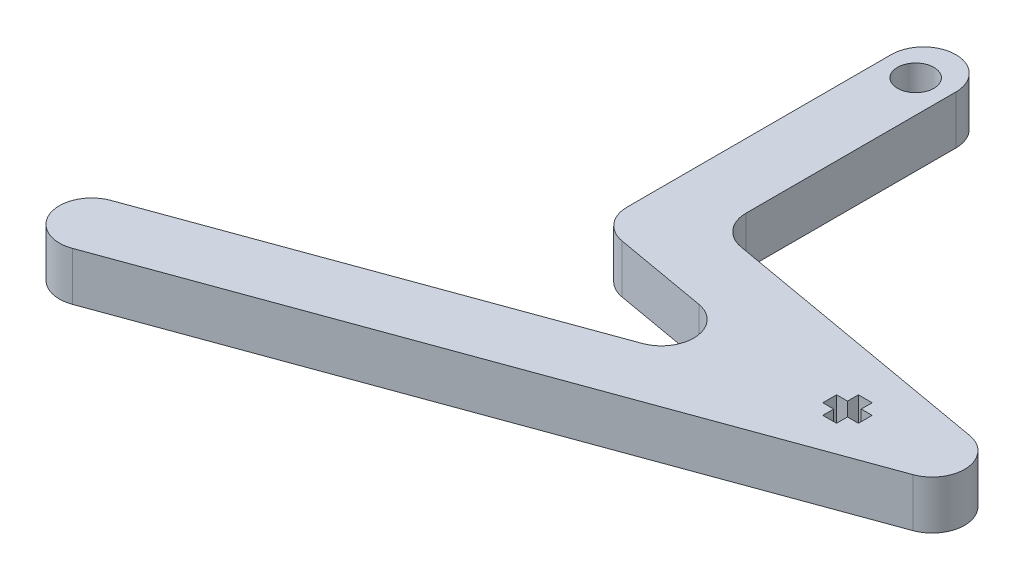
ISO-10303-21;
HEADER;
FILE_DESCRIPTION(('STEP AP214'),'2;1');
FILE_NAME('part.step','',(''),(''),'','','');
FILE_SCHEMA(('AUTOMOTIVE_DESIGN { 1 0 10303 214 1 1 1 1 }'));
ENDSEC;
DATA;
#1=APPLICATION_CONTEXT('core data for automotive mechanical design processes');
#2=APPLICATION_PROTOCOL_DEFINITION('international standard','automotive_design',2000,#1);
#3=PRODUCT_CONTEXT('',#1,'mechanical');
#4=PRODUCT('Part','Part','',(#3));
#5=PRODUCT_RELATED_PRODUCT_CATEGORY('part','',(#4));
#6=PRODUCT_DEFINITION_FORMATION('','',#4);
#7=PRODUCT_DEFINITION_CONTEXT('part definition',#1,'design');
#8=PRODUCT_DEFINITION('design','',#6,#7);
#9=PRODUCT_DEFINITION_SHAPE('','',#8);
#10=(LENGTH_UNIT() NAMED_UNIT(*) SI_UNIT(.MILLI.,.METRE.));
#11=(NAMED_UNIT(*) PLANE_ANGLE_UNIT() SI_UNIT($,.RADIAN.));
#12=(NAMED_UNIT(*) SI_UNIT($,.STERADIAN.) SOLID_ANGLE_UNIT());
#13=UNCERTAINTY_MEASURE_WITH_UNIT(LENGTH_MEASURE(1.E-05),#10,'distance_accuracy_value','');
#14=(GEOMETRIC_REPRESENTATION_CONTEXT(3) GLOBAL_UNCERTAINTY_ASSIGNED_CONTEXT((#13)) GLOBAL_UNIT_ASSIGNED_CONTEXT((#10,
#11,#12)) REPRESENTATION_CONTEXT('',''));
#15=CARTESIAN_POINT('',(0.,0.,0.));
#16=DIRECTION('',(0.,0.,1.));
#17=DIRECTION('',(1.,0.,0.));
#18=AXIS2_PLACEMENT_3D('',#15,#16,#17);
#19=CARTESIAN_POINT('',(0.,6.,0.));
#20=DIRECTION('',(0.,1.,0.));
#21=DIRECTION('',(0.,0.,1.));
#22=AXIS2_PLACEMENT_3D('',#19,#20,#21);
#23=PLANE('',#22);
#24=DIRECTION('',(0.,0.,1.));
#25=VECTOR('',#24,1.);
#26=CARTESIAN_POINT('',(-38.433012349143,6.,-5.2517052601802));
#27=LINE('',#26,#25);
#28=CARTESIAN_POINT('',(-38.433012349143,6.,-5.2517052601802));
#29=VERTEX_POINT('',#28);
#30=CARTESIAN_POINT('',(-38.433012349143,6.,-3.5517052601802));
#31=VERTEX_POINT('',#30);
#32=EDGE_CURVE('E229',#29,#31,#27,.T.);
#33=ORIENTED_EDGE('',*,*,#32,.F.);
#34=DIRECTION('',(-1.,0.,0.));
#35=VECTOR('',#34,1.);
#36=CARTESIAN_POINT('',(-37.083012349143,6.,-5.2517052601802));
#37=LINE('',#36,#35);
#38=CARTESIAN_POINT('',(-37.083012349143,6.,-5.2517052601802));
#39=VERTEX_POINT('',#38);
#40=EDGE_CURVE('E219',#39,#29,#37,.T.);
#41=ORIENTED_EDGE('',*,*,#40,.F.);
#42=DIRECTION('',(0.,0.,1.));
#43=VECTOR('',#42,1.);
#44=CARTESIAN_POINT('',(-37.083012349143,6.,-6.60170526018021));
#45=LINE('',#44,#43);
#46=CARTESIAN_POINT('',(-37.083012349143,6.,-6.60170526018021));
#47=VERTEX_POINT('',#46);
#48=EDGE_CURVE('E264',#47,#39,#45,.T.);
#49=ORIENTED_EDGE('',*,*,#48,.F.);
#50=DIRECTION('',(-1.,0.,0.));
#51=VECTOR('',#50,1.);
#52=CARTESIAN_POINT('',(-35.383012349143,6.,-6.60170526018021));
#53=LINE('',#52,#51);
#54=CARTESIAN_POINT('',(-35.383012349143,6.,-6.60170526018021));
#55=VERTEX_POINT('',#54);
#56=EDGE_CURVE('E261',#55,#47,#53,.T.);
#57=ORIENTED_EDGE('',*,*,#56,.F.);
#58=DIRECTION('',(0.,0.,-1.));
#59=VECTOR('',#58,1.);
#60=CARTESIAN_POINT('',(-35.383012349143,6.,-5.2517052601802));
#61=LINE('',#60,#59);
#62=CARTESIAN_POINT('',(-35.383012349143,6.,-5.2517052601802));
#63=VERTEX_POINT('',#62);
#64=EDGE_CURVE('E259',#63,#55,#61,.T.);
#65=ORIENTED_EDGE('',*,*,#64,.F.);
#66=DIRECTION('',(-1.,0.,0.));
#67=VECTOR('',#66,1.);
#68=CARTESIAN_POINT('',(-34.033012349143,6.,-5.2517052601802));
#69=LINE('',#68,#67);
#70=CARTESIAN_POINT('',(-34.033012349143,6.,-5.2517052601802));
#71=VERTEX_POINT('',#70);
#72=EDGE_CURVE('E257',#71,#63,#69,.T.);
#73=ORIENTED_EDGE('',*,*,#72,.F.);
#74=DIRECTION('',(0.,0.,-1.));
#75=VECTOR('',#74,1.);
#76=CARTESIAN_POINT('',(-34.033012349143,6.,-3.5517052601802));
#77=LINE('',#76,#75);
#78=CARTESIAN_POINT('',(-34.033012349143,6.,-3.5517052601802));
#79=VERTEX_POINT('',#78);
#80=EDGE_CURVE('E255',#79,#71,#77,.T.);
#81=ORIENTED_EDGE('',*,*,#80,.F.);
#82=DIRECTION('',(1.,0.,0.));
#83=VECTOR('',#82,1.);
#84=CARTESIAN_POINT('',(-35.383012349143,6.,-3.5517052601802));
#85=LINE('',#84,#83);
#86=CARTESIAN_POINT('',(-35.383012349143,6.,-3.5517052601802));
#87=VERTEX_POINT('',#86);
#88=EDGE_CURVE('E253',#87,#79,#85,.T.);
#89=ORIENTED_EDGE('',*,*,#88,.F.);
#90=DIRECTION('',(0.,0.,-1.));
#91=VECTOR('',#90,1.);
#92=CARTESIAN_POINT('',(-35.383012349143,6.,-2.2017052601802));
#93=LINE('',#92,#91);
#94=CARTESIAN_POINT('',(-35.383012349143,6.,-2.2017052601802));
#95=VERTEX_POINT('',#94);
#96=EDGE_CURVE('E251',#95,#87,#93,.T.);
#97=ORIENTED_EDGE('',*,*,#96,.F.);
#98=DIRECTION('',(1.,0.,0.));
#99=VECTOR('',#98,1.);
#100=CARTESIAN_POINT('',(-37.083012349143,6.,-2.2017052601802));
#101=LINE('',#100,#99);
#102=CARTESIAN_POINT('',(-37.083012349143,6.,-2.2017052601802));
#103=VERTEX_POINT('',#102);
#104=EDGE_CURVE('E249',#103,#95,#101,.T.);
#105=ORIENTED_EDGE('',*,*,#104,.F.);
#106=DIRECTION('',(0.,0.,1.));
#107=VECTOR('',#106,1.);
#108=CARTESIAN_POINT('',(-37.083012349143,6.,-3.5517052601802));
#109=LINE('',#108,#107);
#110=CARTESIAN_POINT('',(-37.083012349143,6.,-3.5517052601802));
#111=VERTEX_POINT('',#110);
#112=EDGE_CURVE('E244',#111,#103,#109,.T.);
#113=ORIENTED_EDGE('',*,*,#112,.F.);
#114=DIRECTION('',(1.,0.,0.));
#115=VECTOR('',#114,1.);
#116=CARTESIAN_POINT('',(-38.433012349143,6.,-3.5517052601802));
#117=LINE('',#116,#115);
#118=EDGE_CURVE('E242',#31,#111,#117,.T.);
#119=ORIENTED_EDGE('',*,*,#118,.F.);
#120=EDGE_LOOP('',(#33,#41,#49,#57,#65,#73,#81,#89,#97,#105,#113,#119));
#121=FACE_BOUND('',#120,.T.);
#122=DIRECTION('',(0.,0.,1.));
#123=VECTOR('',#122,1.);
#124=CARTESIAN_POINT('',(-71.4790407486558,6.,-49.0484446942367));
#125=LINE('',#124,#123);
#126=CARTESIAN_POINT('',(-71.4790407486558,6.,-45.0484446942367));
#127=VERTEX_POINT('',#126);
#128=CARTESIAN_POINT('',(-71.4790407486558,6.,-12.4048432189458));
#129=VERTEX_POINT('',#128);
#130=EDGE_CURVE('E319',#127,#129,#125,.T.);
#131=ORIENTED_EDGE('',*,*,#130,.T.);
#132=CARTESIAN_POINT('',(-67.4790407486558,6.,-12.4048432189458));
#133=DIRECTION('',(0.,1.,0.));
#134=DIRECTION('',(0.,0.,1.));
#135=AXIS2_PLACEMENT_3D('',#132,#133,#134);
#136=CIRCLE('',#135,4.);
#137=CARTESIAN_POINT('',(-68.1736334593235,6.,-8.46561220689699));
#138=VERTEX_POINT('',#137);
#139=EDGE_CURVE('E393',#129,#138,#136,.T.);
#140=ORIENTED_EDGE('',*,*,#139,.T.);
#141=DIRECTION('',(0.984807753012207,0.,0.173648177666934));
#142=VECTOR('',#141,1.);
#143=CARTESIAN_POINT('',(-71.4790407486558,6.,-9.04844469423671));
#144=LINE('',#143,#142);
#145=CARTESIAN_POINT('',(-56.636218438007,6.,-6.43125465100771));
#146=VERTEX_POINT('',#145);
#147=EDGE_CURVE('E322',#138,#146,#144,.T.);
#148=ORIENTED_EDGE('',*,*,#147,.T.);
#149=CARTESIAN_POINT('',(-57.3308111486747,6.,-2.49202363895887));
#150=DIRECTION('',(0.,1.,0.));
#151=DIRECTION('',(0.,0.,1.));
#152=AXIS2_PLACEMENT_3D('',#149,#150,#151);
#153=CIRCLE('',#152,4.);
#154=CARTESIAN_POINT('',(-55.962730575372,6.,1.26674684418477));
#155=VERTEX_POINT('',#154);
#156=EDGE_CURVE('E11',#146,#155,#153,.F.);
#157=ORIENTED_EDGE('',*,*,#156,.T.);
#158=DIRECTION('',(-0.939692620785912,0.,0.34202014332566));
#159=VECTOR('',#158,1.);
#160=CARTESIAN_POINT('',(-41.9348081582896,6.,-3.83899936422869));
#161=LINE('',#160,#159);
#162=CARTESIAN_POINT('',(-104.089454919572,6.,18.7834419782077));
#163=VERTEX_POINT('',#162);
#164=EDGE_CURVE('E326',#155,#163,#161,.T.);
#165=ORIENTED_EDGE('',*,*,#164,.T.);
#166=CARTESIAN_POINT('',(-102.72137434627,6.,22.5422124613514));
#167=DIRECTION('',(0.,1.,0.));
#168=DIRECTION('',(0.,0.,1.));
#169=AXIS2_PLACEMENT_3D('',#166,#167,#168);
#170=CIRCLE('',#169,4.);
#171=CARTESIAN_POINT('',(-106.480144829413,6.,23.910293034654));
#172=VERTEX_POINT('',#171);
#173=EDGE_CURVE('E390',#163,#172,#170,.T.);
#174=ORIENTED_EDGE('',*,*,#173,.T.);
#175=CARTESIAN_POINT('',(-102.72137434627,6.,22.5422124613514));
#176=DIRECTION('',(0.,1.,0.));
#177=DIRECTION('',(0.,0.,1.));
#178=AXIS2_PLACEMENT_3D('',#175,#176,#177);
#179=CIRCLE('',#178,4.);
#180=CARTESIAN_POINT('',(-101.353293772967,6.,26.300982944495));
#181=VERTEX_POINT('',#180);
#182=EDGE_CURVE('E67',#172,#181,#179,.T.);
#183=ORIENTED_EDGE('',*,*,#182,.T.);
#184=DIRECTION('',(0.939692620785912,0.,-0.34202014332566));
#185=VECTOR('',#184,1.);
#186=CARTESIAN_POINT('',(-105.112064256111,6.,27.6690635177977));
#187=LINE('',#186,#185);
#188=CARTESIAN_POINT('',(-25.1707245946019,6.,-1.42720460635487));
#189=VERTEX_POINT('',#188);
#190=EDGE_CURVE('E329',#181,#189,#187,.T.);
#191=ORIENTED_EDGE('',*,*,#190,.T.);
#192=CARTESIAN_POINT('',(-26.5388051679045,6.,-5.18597508949852));
#193=DIRECTION('',(0.,1.,0.));
#194=DIRECTION('',(0.,0.,1.));
#195=AXIS2_PLACEMENT_3D('',#192,#193,#194);
#196=CIRCLE('',#195,4.);
#197=CARTESIAN_POINT('',(-25.8442124572368,6.,-9.12520610154735));
#198=VERTEX_POINT('',#197);
#199=EDGE_CURVE('E388',#189,#198,#196,.T.);
#200=ORIENTED_EDGE('',*,*,#199,.T.);
#201=DIRECTION('',(-0.984807753012207,0.,-0.173648177666934));
#202=VECTOR('',#201,1.);
#203=CARTESIAN_POINT('',(-63.4790407486558,6.,-15.7612417436549));
#204=LINE('',#203,#202);
#205=CARTESIAN_POINT('',(-60.1736334593235,6.,-15.1784092563152));
#206=VERTEX_POINT('',#205);
#207=EDGE_CURVE('E331',#198,#206,#204,.T.);
#208=ORIENTED_EDGE('',*,*,#207,.T.);
#209=CARTESIAN_POINT('',(-59.4790407486558,6.,-19.117640268364));
#210=DIRECTION('',(0.,1.,0.));
#211=DIRECTION('',(0.,0.,1.));
#212=AXIS2_PLACEMENT_3D('',#209,#210,#211);
#213=CIRCLE('',#212,4.);
#214=CARTESIAN_POINT('',(-63.4790407486558,6.,-19.117640268364));
#215=VERTEX_POINT('',#214);
#216=EDGE_CURVE('E406',#206,#215,#213,.F.);
#217=ORIENTED_EDGE('',*,*,#216,.T.);
#218=DIRECTION('',(0.,0.,-1.));
#219=VECTOR('',#218,1.);
#220=CARTESIAN_POINT('',(-63.4790407486558,6.,-15.7612417436549));
#221=LINE('',#220,#219);
#222=CARTESIAN_POINT('',(-63.4790407486558,6.,-45.0484446942367));
#223=VERTEX_POINT('',#222);
#224=EDGE_CURVE('E334',#215,#223,#221,.T.);
#225=ORIENTED_EDGE('',*,*,#224,.T.);
#226=CARTESIAN_POINT('',(-67.4790407486558,6.,-45.0484446942367));
#227=DIRECTION('',(0.,1.,0.));
#228=DIRECTION('',(0.,0.,1.));
#229=AXIS2_PLACEMENT_3D('',#226,#227,#228);
#230=CIRCLE('',#229,4.);
#231=CARTESIAN_POINT('',(-67.4790407486558,6.,-49.0484446942367));
#232=VERTEX_POINT('',#231);
#233=EDGE_CURVE('E386',#223,#232,#230,.T.);
#234=ORIENTED_EDGE('',*,*,#233,.T.);
#235=CARTESIAN_POINT('',(-67.4790407486558,6.,-45.0484446942367));
#236=DIRECTION('',(0.,1.,0.));
#237=DIRECTION('',(0.,0.,1.));
#238=AXIS2_PLACEMENT_3D('',#235,#236,#237);
#239=CIRCLE('',#238,4.);
#240=EDGE_CURVE('E384',#232,#127,#239,.T.);
#241=ORIENTED_EDGE('',*,*,#240,.T.);
#242=EDGE_LOOP('',(#131,#140,#148,#157,#165,#174,#183,#191,#200,#208,#217,#225,#234,#241));
#243=FACE_BOUND('',#242,.T.);
#244=CARTESIAN_POINT('',(-67.4790407486558,6.,-44.0774757166165));
#245=DIRECTION('',(0.,1.,0.));
#246=DIRECTION('',(0.,0.,1.));
#247=AXIS2_PLACEMENT_3D('',#244,#245,#246);
#248=CIRCLE('',#247,2.25);
#249=CARTESIAN_POINT('',(-67.4790407486558,6.,-41.8274757166165));
#250=VERTEX_POINT('',#249);
#251=EDGE_CURVE('E268',#250,#250,#248,.T.);
#252=ORIENTED_EDGE('',*,*,#251,.F.);
#253=EDGE_LOOP('',(#252));
#254=FACE_BOUND('',#253,.T.);
#255=ADVANCED_FACE('F43',(#121,#243,#254),#23,.T.);
#256=CARTESIAN_POINT('',(0.,0.,0.));
#257=DIRECTION('',(0.,1.,0.));
#258=DIRECTION('',(0.,0.,1.));
#259=AXIS2_PLACEMENT_3D('',#256,#257,#258);
#260=PLANE('',#259);
#261=DIRECTION('',(0.984807753012207,0.,0.173648177666934));
#262=VECTOR('',#261,1.);
#263=CARTESIAN_POINT('',(-71.4790407486558,0.,-9.04844469423671));
#264=LINE('',#263,#262);
#265=CARTESIAN_POINT('',(-68.1736334593235,0.,-8.46561220689699));
#266=VERTEX_POINT('',#265);
#267=CARTESIAN_POINT('',(-56.636218438007,0.,-6.43125465100771));
#268=VERTEX_POINT('',#267);
#269=EDGE_CURVE('E340',#266,#268,#264,.T.);
#270=ORIENTED_EDGE('',*,*,#269,.F.);
#271=CARTESIAN_POINT('',(-67.4790407486558,0.,-12.4048432189458));
#272=DIRECTION('',(0.,1.,0.));
#273=DIRECTION('',(0.,0.,1.));
#274=AXIS2_PLACEMENT_3D('',#271,#272,#273);
#275=CIRCLE('',#274,4.);
#276=CARTESIAN_POINT('',(-71.4790407486558,0.,-12.4048432189458));
#277=VERTEX_POINT('',#276);
#278=EDGE_CURVE('E378',#266,#277,#275,.F.);
#279=ORIENTED_EDGE('',*,*,#278,.T.);
#280=DIRECTION('',(0.,0.,1.));
#281=VECTOR('',#280,1.);
#282=CARTESIAN_POINT('',(-71.4790407486558,0.,-49.0484446942367));
#283=LINE('',#282,#281);
#284=CARTESIAN_POINT('',(-71.4790407486558,0.,-45.0484446942367));
#285=VERTEX_POINT('',#284);
#286=EDGE_CURVE('E237',#285,#277,#283,.T.);
#287=ORIENTED_EDGE('',*,*,#286,.F.);
#288=CARTESIAN_POINT('',(-67.4790407486558,0.,-45.0484446942367));
#289=DIRECTION('',(0.,1.,0.));
#290=DIRECTION('',(0.,0.,1.));
#291=AXIS2_PLACEMENT_3D('',#288,#289,#290);
#292=CIRCLE('',#291,4.);
#293=CARTESIAN_POINT('',(-67.4790407486558,0.,-49.0484446942367));
#294=VERTEX_POINT('',#293);
#295=EDGE_CURVE('E368',#285,#294,#292,.F.);
#296=ORIENTED_EDGE('',*,*,#295,.T.);
#297=CARTESIAN_POINT('',(-67.4790407486558,0.,-45.0484446942367));
#298=DIRECTION('',(0.,1.,0.));
#299=DIRECTION('',(0.,0.,1.));
#300=AXIS2_PLACEMENT_3D('',#297,#298,#299);
#301=CIRCLE('',#300,4.);
#302=CARTESIAN_POINT('',(-63.4790407486558,0.,-45.0484446942367));
#303=VERTEX_POINT('',#302);
#304=EDGE_CURVE('E370',#294,#303,#301,.F.);
#305=ORIENTED_EDGE('',*,*,#304,.T.);
#306=DIRECTION('',(0.,0.,-1.));
#307=VECTOR('',#306,1.);
#308=CARTESIAN_POINT('',(-63.4790407486558,0.,-15.7612417436549));
#309=LINE('',#308,#307);
#310=CARTESIAN_POINT('',(-63.4790407486558,0.,-19.117640268364));
#311=VERTEX_POINT('',#310);
#312=EDGE_CURVE('E323',#311,#303,#309,.T.);
#313=ORIENTED_EDGE('',*,*,#312,.F.);
#314=CARTESIAN_POINT('',(-59.4790407486558,0.,-19.117640268364));
#315=DIRECTION('',(0.,1.,0.));
#316=DIRECTION('',(0.,0.,1.));
#317=AXIS2_PLACEMENT_3D('',#314,#315,#316);
#318=CIRCLE('',#317,4.);
#319=CARTESIAN_POINT('',(-60.1736334593235,0.,-15.1784092563152));
#320=VERTEX_POINT('',#319);
#321=EDGE_CURVE('E404',#311,#320,#318,.T.);
#322=ORIENTED_EDGE('',*,*,#321,.T.);
#323=DIRECTION('',(-0.984807753012207,0.,-0.173648177666934));
#324=VECTOR('',#323,1.);
#325=CARTESIAN_POINT('',(-63.4790407486558,0.,-15.7612417436549));
#326=LINE('',#325,#324);
#327=CARTESIAN_POINT('',(-25.8442124572368,0.,-9.12520610154735));
#328=VERTEX_POINT('',#327);
#329=EDGE_CURVE('E348',#328,#320,#326,.T.);
#330=ORIENTED_EDGE('',*,*,#329,.F.);
#331=CARTESIAN_POINT('',(-26.5388051679045,0.,-5.18597508949852));
#332=DIRECTION('',(0.,1.,0.));
#333=DIRECTION('',(0.,0.,1.));
#334=AXIS2_PLACEMENT_3D('',#331,#332,#333);
#335=CIRCLE('',#334,4.);
#336=CARTESIAN_POINT('',(-25.1707245946019,0.,-1.42720460635487));
#337=VERTEX_POINT('',#336);
#338=EDGE_CURVE('E372',#328,#337,#335,.F.);
#339=ORIENTED_EDGE('',*,*,#338,.T.);
#340=DIRECTION('',(0.939692620785912,0.,-0.34202014332566));
#341=VECTOR('',#340,1.);
#342=CARTESIAN_POINT('',(-105.112064256111,0.,27.6690635177977));
#343=LINE('',#342,#341);
#344=CARTESIAN_POINT('',(-101.353293772967,0.,26.300982944495));
#345=VERTEX_POINT('',#344);
#346=EDGE_CURVE('E346',#345,#337,#343,.T.);
#347=ORIENTED_EDGE('',*,*,#346,.F.);
#348=CARTESIAN_POINT('',(-102.72137434627,0.,22.5422124613514));
#349=DIRECTION('',(0.,1.,0.));
#350=DIRECTION('',(0.,0.,1.));
#351=AXIS2_PLACEMENT_3D('',#348,#349,#350);
#352=CIRCLE('',#351,4.);
#353=CARTESIAN_POINT('',(-106.480144829413,0.,23.910293034654));
#354=VERTEX_POINT('',#353);
#355=EDGE_CURVE('E376',#345,#354,#352,.F.);
#356=ORIENTED_EDGE('',*,*,#355,.T.);
#357=CARTESIAN_POINT('',(-102.72137434627,0.,22.5422124613514));
#358=DIRECTION('',(0.,1.,0.));
#359=DIRECTION('',(0.,0.,1.));
#360=AXIS2_PLACEMENT_3D('',#357,#358,#359);
#361=CIRCLE('',#360,4.);
#362=CARTESIAN_POINT('',(-104.089454919572,0.,18.7834419782077));
#363=VERTEX_POINT('',#362);
#364=EDGE_CURVE('E374',#354,#363,#361,.F.);
#365=ORIENTED_EDGE('',*,*,#364,.T.);
#366=DIRECTION('',(-0.939692620785912,0.,0.34202014332566));
#367=VECTOR('',#366,1.);
#368=CARTESIAN_POINT('',(-41.9348081582896,0.,-3.83899936422869));
#369=LINE('',#368,#367);
#370=CARTESIAN_POINT('',(-55.962730575372,0.,1.26674684418477));
#371=VERTEX_POINT('',#370);
#372=EDGE_CURVE('E343',#371,#363,#369,.T.);
#373=ORIENTED_EDGE('',*,*,#372,.F.);
#374=CARTESIAN_POINT('',(-57.3308111486747,0.,-2.49202363895887));
#375=DIRECTION('',(0.,1.,0.));
#376=DIRECTION('',(0.,0.,1.));
#377=AXIS2_PLACEMENT_3D('',#374,#375,#376);
#378=CIRCLE('',#377,4.);
#379=EDGE_CURVE('E52',#371,#268,#378,.T.);
#380=ORIENTED_EDGE('',*,*,#379,.T.);
#381=EDGE_LOOP('',(#270,#279,#287,#296,#305,#313,#322,#330,#339,#347,#356,#365,#373,#380));
#382=FACE_BOUND('',#381,.T.);
#383=DIRECTION('',(-1.,0.,0.));
#384=VECTOR('',#383,1.);
#385=CARTESIAN_POINT('',(-37.083012349143,0.,-5.2517052601802));
#386=LINE('',#385,#384);
#387=CARTESIAN_POINT('',(-37.083012349143,0.,-5.2517052601802));
#388=VERTEX_POINT('',#387);
#389=CARTESIAN_POINT('',(-38.433012349143,0.,-5.2517052601802));
#390=VERTEX_POINT('',#389);
#391=EDGE_CURVE('E266',#388,#390,#386,.T.);
#392=ORIENTED_EDGE('',*,*,#391,.T.);
#393=DIRECTION('',(0.,0.,1.));
#394=VECTOR('',#393,1.);
#395=CARTESIAN_POINT('',(-38.433012349143,0.,-5.2517052601802));
#396=LINE('',#395,#394);
#397=CARTESIAN_POINT('',(-38.433012349143,0.,-3.5517052601802));
#398=VERTEX_POINT('',#397);
#399=EDGE_CURVE('E236',#390,#398,#396,.T.);
#400=ORIENTED_EDGE('',*,*,#399,.T.);
#401=DIRECTION('',(1.,0.,0.));
#402=VECTOR('',#401,1.);
#403=CARTESIAN_POINT('',(-38.433012349143,0.,-3.5517052601802));
#404=LINE('',#403,#402);
#405=CARTESIAN_POINT('',(-37.083012349143,0.,-3.5517052601802));
#406=VERTEX_POINT('',#405);
#407=EDGE_CURVE('E270',#398,#406,#404,.T.);
#408=ORIENTED_EDGE('',*,*,#407,.T.);
#409=DIRECTION('',(0.,0.,1.));
#410=VECTOR('',#409,1.);
#411=CARTESIAN_POINT('',(-37.083012349143,0.,-3.5517052601802));
#412=LINE('',#411,#410);
#413=CARTESIAN_POINT('',(-37.083012349143,0.,-2.2017052601802));
#414=VERTEX_POINT('',#413);
#415=EDGE_CURVE('E273',#406,#414,#412,.T.);
#416=ORIENTED_EDGE('',*,*,#415,.T.);
#417=DIRECTION('',(1.,0.,0.));
#418=VECTOR('',#417,1.);
#419=CARTESIAN_POINT('',(-37.083012349143,0.,-2.2017052601802));
#420=LINE('',#419,#418);
#421=CARTESIAN_POINT('',(-35.383012349143,0.,-2.2017052601802));
#422=VERTEX_POINT('',#421);
#423=EDGE_CURVE('E276',#414,#422,#420,.T.);
#424=ORIENTED_EDGE('',*,*,#423,.T.);
#425=DIRECTION('',(0.,0.,-1.));
#426=VECTOR('',#425,1.);
#427=CARTESIAN_POINT('',(-35.383012349143,0.,-2.2017052601802));
#428=LINE('',#427,#426);
#429=CARTESIAN_POINT('',(-35.383012349143,0.,-3.5517052601802));
#430=VERTEX_POINT('',#429);
#431=EDGE_CURVE('E279',#422,#430,#428,.T.);
#432=ORIENTED_EDGE('',*,*,#431,.T.);
#433=DIRECTION('',(1.,0.,0.));
#434=VECTOR('',#433,1.);
#435=CARTESIAN_POINT('',(-35.383012349143,0.,-3.5517052601802));
#436=LINE('',#435,#434);
#437=CARTESIAN_POINT('',(-34.033012349143,0.,-3.5517052601802));
#438=VERTEX_POINT('',#437);
#439=EDGE_CURVE('E282',#430,#438,#436,.T.);
#440=ORIENTED_EDGE('',*,*,#439,.T.);
#441=DIRECTION('',(0.,0.,-1.));
#442=VECTOR('',#441,1.);
#443=CARTESIAN_POINT('',(-34.033012349143,0.,-3.5517052601802));
#444=LINE('',#443,#442);
#445=CARTESIAN_POINT('',(-34.033012349143,0.,-5.2517052601802));
#446=VERTEX_POINT('',#445);
#447=EDGE_CURVE('E285',#438,#446,#444,.T.);
#448=ORIENTED_EDGE('',*,*,#447,.T.);
#449=DIRECTION('',(-1.,0.,0.));
#450=VECTOR('',#449,1.);
#451=CARTESIAN_POINT('',(-34.033012349143,0.,-5.2517052601802));
#452=LINE('',#451,#450);
#453=CARTESIAN_POINT('',(-35.383012349143,0.,-5.2517052601802));
#454=VERTEX_POINT('',#453);
#455=EDGE_CURVE('E288',#446,#454,#452,.T.);
#456=ORIENTED_EDGE('',*,*,#455,.T.);
#457=DIRECTION('',(0.,0.,-1.));
#458=VECTOR('',#457,1.);
#459=CARTESIAN_POINT('',(-35.383012349143,0.,-5.2517052601802));
#460=LINE('',#459,#458);
#461=CARTESIAN_POINT('',(-35.383012349143,0.,-6.60170526018021));
#462=VERTEX_POINT('',#461);
#463=EDGE_CURVE('E291',#454,#462,#460,.T.);
#464=ORIENTED_EDGE('',*,*,#463,.T.);
#465=DIRECTION('',(-1.,0.,0.));
#466=VECTOR('',#465,1.);
#467=CARTESIAN_POINT('',(-35.383012349143,0.,-6.60170526018021));
#468=LINE('',#467,#466);
#469=CARTESIAN_POINT('',(-37.083012349143,0.,-6.60170526018021));
#470=VERTEX_POINT('',#469);
#471=EDGE_CURVE('E294',#462,#470,#468,.T.);
#472=ORIENTED_EDGE('',*,*,#471,.T.);
#473=DIRECTION('',(0.,0.,1.));
#474=VECTOR('',#473,1.);
#475=CARTESIAN_POINT('',(-37.083012349143,0.,-6.60170526018021));
#476=LINE('',#475,#474);
#477=EDGE_CURVE('E230',#470,#388,#476,.T.);
#478=ORIENTED_EDGE('',*,*,#477,.T.);
#479=EDGE_LOOP('',(#392,#400,#408,#416,#424,#432,#440,#448,#456,#464,#472,#478));
#480=FACE_BOUND('',#479,.T.);
#481=CARTESIAN_POINT('',(-67.4790407486558,0.,-44.0774757166165));
#482=DIRECTION('',(0.,1.,0.));
#483=DIRECTION('',(0.,0.,1.));
#484=AXIS2_PLACEMENT_3D('',#481,#482,#483);
#485=CIRCLE('',#484,2.25);
#486=CARTESIAN_POINT('',(-67.4790407486558,0.,-41.8274757166165));
#487=VERTEX_POINT('',#486);
#488=EDGE_CURVE('E410',#487,#487,#485,.T.);
#489=ORIENTED_EDGE('',*,*,#488,.T.);
#490=EDGE_LOOP('',(#489));
#491=FACE_BOUND('',#490,.T.);
#492=ADVANCED_FACE('F457',(#382,#480,#491),#260,.F.);
#493=CARTESIAN_POINT('',(-71.4790407486558,6.,-49.0484446942367));
#494=DIRECTION('',(1.,0.,0.));
#495=DIRECTION('',(0.,0.,-1.));
#496=AXIS2_PLACEMENT_3D('',#493,#494,#495);
#497=PLANE('',#496);
#498=ORIENTED_EDGE('',*,*,#286,.T.);
#499=DIRECTION('',(0.,-1.,0.));
#500=VECTOR('',#499,1.);
#501=CARTESIAN_POINT('',(-71.4790407486558,6.,-12.4048432189458));
#502=LINE('',#501,#500);
#503=EDGE_CURVE('E382',#277,#129,#502,.F.);
#504=ORIENTED_EDGE('',*,*,#503,.T.);
#505=ORIENTED_EDGE('',*,*,#130,.F.);
#506=DIRECTION('',(0.,-1.,0.));
#507=VECTOR('',#506,1.);
#508=CARTESIAN_POINT('',(-71.4790407486558,6.,-45.0484446942367));
#509=LINE('',#508,#507);
#510=EDGE_CURVE('E380',#127,#285,#509,.T.);
#511=ORIENTED_EDGE('',*,*,#510,.T.);
#512=EDGE_LOOP('',(#498,#504,#505,#511));
#513=FACE_BOUND('',#512,.T.);
#514=ADVANCED_FACE('F428',(#513),#497,.F.);
#515=CARTESIAN_POINT('',(-71.4790407486558,6.,-9.04844469423671));
#516=DIRECTION('',(0.173648177666934,0.,-0.984807753012207));
#517=DIRECTION('',(-0.984807753012208,0.,-0.173648177666934));
#518=AXIS2_PLACEMENT_3D('',#515,#516,#517);
#519=PLANE('',#518);
#520=ORIENTED_EDGE('',*,*,#147,.F.);
#521=DIRECTION('',(0.,-1.,0.));
#522=VECTOR('',#521,1.);
#523=CARTESIAN_POINT('',(-68.1736334593235,6.,-8.46561220689699));
#524=LINE('',#523,#522);
#525=EDGE_CURVE('E365',#138,#266,#524,.T.);
#526=ORIENTED_EDGE('',*,*,#525,.T.);
#527=ORIENTED_EDGE('',*,*,#269,.T.);
#528=DIRECTION('',(0.,-1.,0.));
#529=VECTOR('',#528,1.);
#530=CARTESIAN_POINT('',(-56.636218438007,6.,-6.4312546510077));
#531=LINE('',#530,#529);
#532=EDGE_CURVE('E363',#268,#146,#531,.F.);
#533=ORIENTED_EDGE('',*,*,#532,.T.);
#534=EDGE_LOOP('',(#520,#526,#527,#533));
#535=FACE_BOUND('',#534,.T.);
#536=ADVANCED_FACE('F437',(#535),#519,.F.);
#537=CARTESIAN_POINT('',(-41.9348081582896,6.,-3.83899936422869));
#538=DIRECTION('',(0.34202014332566,0.,0.939692620785912));
#539=DIRECTION('',(0.939692620785912,0.,-0.34202014332566));
#540=AXIS2_PLACEMENT_3D('',#537,#538,#539);
#541=PLANE('',#540);
#542=ORIENTED_EDGE('',*,*,#372,.T.);
#543=DIRECTION('',(0.,-1.,0.));
#544=VECTOR('',#543,1.);
#545=CARTESIAN_POINT('',(-104.089454919572,6.,18.7834419782077));
#546=LINE('',#545,#544);
#547=EDGE_CURVE('E402',#363,#163,#546,.F.);
#548=ORIENTED_EDGE('',*,*,#547,.T.);
#549=ORIENTED_EDGE('',*,*,#164,.F.);
#550=DIRECTION('',(0.,-1.,0.));
#551=VECTOR('',#550,1.);
#552=CARTESIAN_POINT('',(-55.962730575372,0.,1.26674684418478));
#553=LINE('',#552,#551);
#554=EDGE_CURVE('E399',#155,#371,#553,.T.);
#555=ORIENTED_EDGE('',*,*,#554,.T.);
#556=EDGE_LOOP('',(#542,#548,#549,#555));
#557=FACE_BOUND('',#556,.T.);
#558=ADVANCED_FACE('F446',(#557),#541,.F.);
#559=CARTESIAN_POINT('',(-105.112064256111,6.,27.6690635177977));
#560=DIRECTION('',(-0.34202014332566,0.,-0.939692620785912));
#561=DIRECTION('',(-0.939692620785912,0.,0.34202014332566));
#562=AXIS2_PLACEMENT_3D('',#559,#560,#561);
#563=PLANE('',#562);
#564=ORIENTED_EDGE('',*,*,#190,.F.);
#565=DIRECTION('',(0.,-1.,0.));
#566=VECTOR('',#565,1.);
#567=CARTESIAN_POINT('',(-101.353293772967,6.,26.300982944495));
#568=LINE('',#567,#566);
#569=EDGE_CURVE('E396',#181,#345,#568,.T.);
#570=ORIENTED_EDGE('',*,*,#569,.T.);
#571=ORIENTED_EDGE('',*,*,#346,.T.);
#572=DIRECTION('',(0.,-1.,0.));
#573=VECTOR('',#572,1.);
#574=CARTESIAN_POINT('',(-25.1707245946019,6.,-1.42720460635487));
#575=LINE('',#574,#573);
#576=EDGE_CURVE('E60',#337,#189,#575,.F.);
#577=ORIENTED_EDGE('',*,*,#576,.T.);
#578=EDGE_LOOP('',(#564,#570,#571,#577));
#579=FACE_BOUND('',#578,.T.);
#580=ADVANCED_FACE('F455',(#579),#563,.F.);
#581=CARTESIAN_POINT('',(-63.4790407486558,6.,-15.7612417436549));
#582=DIRECTION('',(-0.173648177666934,0.,0.984807753012207));
#583=DIRECTION('',(0.984807753012208,0.,0.173648177666934));
#584=AXIS2_PLACEMENT_3D('',#581,#582,#583);
#585=PLANE('',#584);
#586=ORIENTED_EDGE('',*,*,#329,.T.);
#587=DIRECTION('',(0.,-1.,0.));
#588=VECTOR('',#587,1.);
#589=CARTESIAN_POINT('',(-60.1736334593235,6.,-15.1784092563152));
#590=LINE('',#589,#588);
#591=EDGE_CURVE('E361',#320,#206,#590,.F.);
#592=ORIENTED_EDGE('',*,*,#591,.T.);
#593=ORIENTED_EDGE('',*,*,#207,.F.);
#594=DIRECTION('',(0.,-1.,0.));
#595=VECTOR('',#594,1.);
#596=CARTESIAN_POINT('',(-25.8442124572367,6.,-9.12520610154735));
#597=LINE('',#596,#595);
#598=EDGE_CURVE('E358',#198,#328,#597,.T.);
#599=ORIENTED_EDGE('',*,*,#598,.T.);
#600=EDGE_LOOP('',(#586,#592,#593,#599));
#601=FACE_BOUND('',#600,.T.);
#602=ADVANCED_FACE('F466',(#601),#585,.F.);
#603=CARTESIAN_POINT('',(-63.4790407486558,6.,-15.7612417436549));
#604=DIRECTION('',(-1.,0.,0.));
#605=DIRECTION('',(0.,0.,1.));
#606=AXIS2_PLACEMENT_3D('',#603,#604,#605);
#607=PLANE('',#606);
#608=ORIENTED_EDGE('',*,*,#224,.F.);
#609=DIRECTION('',(0.,-1.,0.));
#610=VECTOR('',#609,1.);
#611=CARTESIAN_POINT('',(-63.4790407486558,0.,-19.117640268364));
#612=LINE('',#611,#610);
#613=EDGE_CURVE('E355',#215,#311,#612,.T.);
#614=ORIENTED_EDGE('',*,*,#613,.T.);
#615=ORIENTED_EDGE('',*,*,#312,.T.);
#616=DIRECTION('',(0.,-1.,0.));
#617=VECTOR('',#616,1.);
#618=CARTESIAN_POINT('',(-63.4790407486558,6.,-45.0484446942367));
#619=LINE('',#618,#617);
#620=EDGE_CURVE('E337',#303,#223,#619,.F.);
#621=ORIENTED_EDGE('',*,*,#620,.T.);
#622=EDGE_LOOP('',(#608,#614,#615,#621));
#623=FACE_BOUND('',#622,.T.);
#624=ADVANCED_FACE('F475',(#623),#607,.F.);
#625=CARTESIAN_POINT('',(-37.083012349143,6.,-5.2517052601802));
#626=DIRECTION('',(0.,0.,1.));
#627=DIRECTION('',(1.,0.,0.));
#628=AXIS2_PLACEMENT_3D('',#625,#626,#627);
#629=PLANE('',#628);
#630=ORIENTED_EDGE('',*,*,#391,.F.);
#631=DIRECTION('',(0.,-1.,0.));
#632=VECTOR('',#631,1.);
#633=CARTESIAN_POINT('',(-37.083012349143,6.,-5.2517052601802));
#634=LINE('',#633,#632);
#635=EDGE_CURVE('E225',#39,#388,#634,.T.);
#636=ORIENTED_EDGE('',*,*,#635,.F.);
#637=ORIENTED_EDGE('',*,*,#40,.T.);
#638=DIRECTION('',(0.,-1.,0.));
#639=VECTOR('',#638,1.);
#640=CARTESIAN_POINT('',(-38.433012349143,6.,-5.2517052601802));
#641=LINE('',#640,#639);
#642=EDGE_CURVE('E222',#29,#390,#641,.T.);
#643=ORIENTED_EDGE('',*,*,#642,.T.);
#644=EDGE_LOOP('',(#630,#636,#637,#643));
#645=FACE_BOUND('',#644,.T.);
#646=ADVANCED_FACE('F221',(#645),#629,.T.);
#647=CARTESIAN_POINT('',(-38.433012349143,6.,-5.2517052601802));
#648=DIRECTION('',(1.,0.,0.));
#649=DIRECTION('',(0.,0.,-1.));
#650=AXIS2_PLACEMENT_3D('',#647,#648,#649);
#651=PLANE('',#650);
#652=ORIENTED_EDGE('',*,*,#399,.F.);
#653=ORIENTED_EDGE('',*,*,#642,.F.);
#654=ORIENTED_EDGE('',*,*,#32,.T.);
#655=DIRECTION('',(0.,-1.,0.));
#656=VECTOR('',#655,1.);
#657=CARTESIAN_POINT('',(-38.433012349143,6.,-3.5517052601802));
#658=LINE('',#657,#656);
#659=EDGE_CURVE('E238',#31,#398,#658,.T.);
#660=ORIENTED_EDGE('',*,*,#659,.T.);
#661=EDGE_LOOP('',(#652,#653,#654,#660));
#662=FACE_BOUND('',#661,.T.);
#663=ADVANCED_FACE('F233',(#662),#651,.T.);
#664=CARTESIAN_POINT('',(-38.433012349143,6.,-3.5517052601802));
#665=DIRECTION('',(0.,0.,-1.));
#666=DIRECTION('',(-1.,0.,0.));
#667=AXIS2_PLACEMENT_3D('',#664,#665,#666);
#668=PLANE('',#667);
#669=ORIENTED_EDGE('',*,*,#407,.F.);
#670=ORIENTED_EDGE('',*,*,#659,.F.);
#671=ORIENTED_EDGE('',*,*,#118,.T.);
#672=DIRECTION('',(0.,-1.,0.));
#673=VECTOR('',#672,1.);
#674=CARTESIAN_POINT('',(-37.083012349143,6.,-3.5517052601802));
#675=LINE('',#674,#673);
#676=EDGE_CURVE('E316',#111,#406,#675,.T.);
#677=ORIENTED_EDGE('',*,*,#676,.T.);
#678=EDGE_LOOP('',(#669,#670,#671,#677));
#679=FACE_BOUND('',#678,.T.);
#680=ADVANCED_FACE('F495',(#679),#668,.T.);
#681=CARTESIAN_POINT('',(-37.083012349143,6.,-3.5517052601802));
#682=DIRECTION('',(1.,0.,0.));
#683=DIRECTION('',(0.,0.,-1.));
#684=AXIS2_PLACEMENT_3D('',#681,#682,#683);
#685=PLANE('',#684);
#686=ORIENTED_EDGE('',*,*,#415,.F.);
#687=ORIENTED_EDGE('',*,*,#676,.F.);
#688=ORIENTED_EDGE('',*,*,#112,.T.);
#689=DIRECTION('',(0.,-1.,0.));
#690=VECTOR('',#689,1.);
#691=CARTESIAN_POINT('',(-37.083012349143,6.,-2.2017052601802));
#692=LINE('',#691,#690);
#693=EDGE_CURVE('E314',#103,#414,#692,.T.);
#694=ORIENTED_EDGE('',*,*,#693,.T.);
#695=EDGE_LOOP('',(#686,#687,#688,#694));
#696=FACE_BOUND('',#695,.T.);
#697=ADVANCED_FACE('F498',(#696),#685,.T.);
#698=CARTESIAN_POINT('',(-37.083012349143,6.,-2.2017052601802));
#699=DIRECTION('',(0.,0.,-1.));
#700=DIRECTION('',(-1.,0.,0.));
#701=AXIS2_PLACEMENT_3D('',#698,#699,#700);
#702=PLANE('',#701);
#703=ORIENTED_EDGE('',*,*,#423,.F.);
#704=ORIENTED_EDGE('',*,*,#693,.F.);
#705=ORIENTED_EDGE('',*,*,#104,.T.);
#706=DIRECTION('',(0.,-1.,0.));
#707=VECTOR('',#706,1.);
#708=CARTESIAN_POINT('',(-35.383012349143,6.,-2.2017052601802));
#709=LINE('',#708,#707);
#710=EDGE_CURVE('E312',#95,#422,#709,.T.);
#711=ORIENTED_EDGE('',*,*,#710,.T.);
#712=EDGE_LOOP('',(#703,#704,#705,#711));
#713=FACE_BOUND('',#712,.T.);
#714=ADVANCED_FACE('F502',(#713),#702,.T.);
#715=CARTESIAN_POINT('',(-35.383012349143,6.,-2.2017052601802));
#716=DIRECTION('',(-1.,0.,0.));
#717=DIRECTION('',(0.,0.,1.));
#718=AXIS2_PLACEMENT_3D('',#715,#716,#717);
#719=PLANE('',#718);
#720=ORIENTED_EDGE('',*,*,#431,.F.);
#721=ORIENTED_EDGE('',*,*,#710,.F.);
#722=ORIENTED_EDGE('',*,*,#96,.T.);
#723=DIRECTION('',(0.,-1.,0.));
#724=VECTOR('',#723,1.);
#725=CARTESIAN_POINT('',(-35.383012349143,6.,-3.5517052601802));
#726=LINE('',#725,#724);
#727=EDGE_CURVE('E310',#87,#430,#726,.T.);
#728=ORIENTED_EDGE('',*,*,#727,.T.);
#729=EDGE_LOOP('',(#720,#721,#722,#728));
#730=FACE_BOUND('',#729,.T.);
#731=ADVANCED_FACE('F506',(#730),#719,.T.);
#732=CARTESIAN_POINT('',(-35.383012349143,6.,-3.5517052601802));
#733=DIRECTION('',(0.,0.,-1.));
#734=DIRECTION('',(-1.,0.,0.));
#735=AXIS2_PLACEMENT_3D('',#732,#733,#734);
#736=PLANE('',#735);
#737=ORIENTED_EDGE('',*,*,#439,.F.);
#738=ORIENTED_EDGE('',*,*,#727,.F.);
#739=ORIENTED_EDGE('',*,*,#88,.T.);
#740=DIRECTION('',(0.,-1.,0.));
#741=VECTOR('',#740,1.);
#742=CARTESIAN_POINT('',(-34.033012349143,6.,-3.5517052601802));
#743=LINE('',#742,#741);
#744=EDGE_CURVE('E308',#79,#438,#743,.T.);
#745=ORIENTED_EDGE('',*,*,#744,.T.);
#746=EDGE_LOOP('',(#737,#738,#739,#745));
#747=FACE_BOUND('',#746,.T.);
#748=ADVANCED_FACE('F510',(#747),#736,.T.);
#749=CARTESIAN_POINT('',(-34.033012349143,6.,-3.5517052601802));
#750=DIRECTION('',(-1.,0.,0.));
#751=DIRECTION('',(0.,0.,1.));
#752=AXIS2_PLACEMENT_3D('',#749,#750,#751);
#753=PLANE('',#752);
#754=ORIENTED_EDGE('',*,*,#447,.F.);
#755=ORIENTED_EDGE('',*,*,#744,.F.);
#756=ORIENTED_EDGE('',*,*,#80,.T.);
#757=DIRECTION('',(0.,-1.,0.));
#758=VECTOR('',#757,1.);
#759=CARTESIAN_POINT('',(-34.033012349143,6.,-5.2517052601802));
#760=LINE('',#759,#758);
#761=EDGE_CURVE('E306',#71,#446,#760,.T.);
#762=ORIENTED_EDGE('',*,*,#761,.T.);
#763=EDGE_LOOP('',(#754,#755,#756,#762));
#764=FACE_BOUND('',#763,.T.);
#765=ADVANCED_FACE('F514',(#764),#753,.T.);
#766=CARTESIAN_POINT('',(-34.033012349143,6.,-5.2517052601802));
#767=DIRECTION('',(0.,0.,1.));
#768=DIRECTION('',(1.,0.,0.));
#769=AXIS2_PLACEMENT_3D('',#766,#767,#768);
#770=PLANE('',#769);
#771=ORIENTED_EDGE('',*,*,#455,.F.);
#772=ORIENTED_EDGE('',*,*,#761,.F.);
#773=ORIENTED_EDGE('',*,*,#72,.T.);
#774=DIRECTION('',(0.,-1.,0.));
#775=VECTOR('',#774,1.);
#776=CARTESIAN_POINT('',(-35.383012349143,6.,-5.2517052601802));
#777=LINE('',#776,#775);
#778=EDGE_CURVE('E304',#63,#454,#777,.T.);
#779=ORIENTED_EDGE('',*,*,#778,.T.);
#780=EDGE_LOOP('',(#771,#772,#773,#779));
#781=FACE_BOUND('',#780,.T.);
#782=ADVANCED_FACE('F518',(#781),#770,.T.);
#783=CARTESIAN_POINT('',(-35.383012349143,6.,-5.2517052601802));
#784=DIRECTION('',(-1.,0.,0.));
#785=DIRECTION('',(0.,0.,1.));
#786=AXIS2_PLACEMENT_3D('',#783,#784,#785);
#787=PLANE('',#786);
#788=ORIENTED_EDGE('',*,*,#463,.F.);
#789=ORIENTED_EDGE('',*,*,#778,.F.);
#790=ORIENTED_EDGE('',*,*,#64,.T.);
#791=DIRECTION('',(0.,-1.,0.));
#792=VECTOR('',#791,1.);
#793=CARTESIAN_POINT('',(-35.383012349143,6.,-6.60170526018021));
#794=LINE('',#793,#792);
#795=EDGE_CURVE('E302',#55,#462,#794,.T.);
#796=ORIENTED_EDGE('',*,*,#795,.T.);
#797=EDGE_LOOP('',(#788,#789,#790,#796));
#798=FACE_BOUND('',#797,.T.);
#799=ADVANCED_FACE('F522',(#798),#787,.T.);
#800=CARTESIAN_POINT('',(-35.383012349143,6.,-6.60170526018021));
#801=DIRECTION('',(0.,0.,1.));
#802=DIRECTION('',(1.,0.,0.));
#803=AXIS2_PLACEMENT_3D('',#800,#801,#802);
#804=PLANE('',#803);
#805=ORIENTED_EDGE('',*,*,#471,.F.);
#806=ORIENTED_EDGE('',*,*,#795,.F.);
#807=ORIENTED_EDGE('',*,*,#56,.T.);
#808=DIRECTION('',(0.,-1.,0.));
#809=VECTOR('',#808,1.);
#810=CARTESIAN_POINT('',(-37.083012349143,6.,-6.60170526018021));
#811=LINE('',#810,#809);
#812=EDGE_CURVE('E300',#47,#470,#811,.T.);
#813=ORIENTED_EDGE('',*,*,#812,.T.);
#814=EDGE_LOOP('',(#805,#806,#807,#813));
#815=FACE_BOUND('',#814,.T.);
#816=ADVANCED_FACE('F526',(#815),#804,.T.);
#817=CARTESIAN_POINT('',(-37.083012349143,6.,-6.60170526018021));
#818=DIRECTION('',(1.,0.,0.));
#819=DIRECTION('',(0.,0.,-1.));
#820=AXIS2_PLACEMENT_3D('',#817,#818,#819);
#821=PLANE('',#820);
#822=ORIENTED_EDGE('',*,*,#477,.F.);
#823=ORIENTED_EDGE('',*,*,#812,.F.);
#824=ORIENTED_EDGE('',*,*,#48,.T.);
#825=ORIENTED_EDGE('',*,*,#635,.T.);
#826=EDGE_LOOP('',(#822,#823,#824,#825));
#827=FACE_BOUND('',#826,.T.);
#828=ADVANCED_FACE('F530',(#827),#821,.T.);
#829=CARTESIAN_POINT('',(-67.4790407486558,6.,-44.0774757166165));
#830=DIRECTION('',(0.,-1.,0.));
#831=DIRECTION('',(0.,0.,-1.));
#832=AXIS2_PLACEMENT_3D('',#829,#830,#831);
#833=CYLINDRICAL_SURFACE('',#832,2.25);
#834=ORIENTED_EDGE('',*,*,#251,.T.);
#835=EDGE_LOOP('',(#834));
#836=FACE_BOUND('',#835,.T.);
#837=ORIENTED_EDGE('',*,*,#488,.F.);
#838=EDGE_LOOP('',(#837));
#839=FACE_BOUND('',#838,.T.);
#840=ADVANCED_FACE('F534',(#836,#839),#833,.F.);
#841=CARTESIAN_POINT('',(-59.4790407486558,6.,-19.117640268364));
#842=DIRECTION('',(0.,1.,0.));
#843=DIRECTION('',(0.,0.,1.));
#844=AXIS2_PLACEMENT_3D('',#841,#842,#843);
#845=CYLINDRICAL_SURFACE('',#844,4.);
#846=ORIENTED_EDGE('',*,*,#216,.F.);
#847=ORIENTED_EDGE('',*,*,#591,.F.);
#848=ORIENTED_EDGE('',*,*,#321,.F.);
#849=ORIENTED_EDGE('',*,*,#613,.F.);
#850=EDGE_LOOP('',(#846,#847,#848,#849));
#851=FACE_BOUND('',#850,.T.);
#852=ADVANCED_FACE('F472',(#851),#845,.F.);
#853=CARTESIAN_POINT('',(-67.4790407486558,6.,-12.4048432189458));
#854=DIRECTION('',(0.,-1.,0.));
#855=DIRECTION('',(0.,0.,-1.));
#856=AXIS2_PLACEMENT_3D('',#853,#854,#855);
#857=CYLINDRICAL_SURFACE('',#856,4.);
#858=ORIENTED_EDGE('',*,*,#139,.F.);
#859=ORIENTED_EDGE('',*,*,#503,.F.);
#860=ORIENTED_EDGE('',*,*,#278,.F.);
#861=ORIENTED_EDGE('',*,*,#525,.F.);
#862=EDGE_LOOP('',(#858,#859,#860,#861));
#863=FACE_BOUND('',#862,.T.);
#864=ADVANCED_FACE('F432',(#863),#857,.T.);
#865=CARTESIAN_POINT('',(-102.72137434627,6.,22.5422124613514));
#866=DIRECTION('',(0.,-1.,0.));
#867=DIRECTION('',(0.,0.,-1.));
#868=AXIS2_PLACEMENT_3D('',#865,#866,#867);
#869=CYLINDRICAL_SURFACE('',#868,4.);
#870=DIRECTION('',(0.,-1.,0.));
#871=VECTOR('',#870,1.);
#872=CARTESIAN_POINT('',(-106.480144829413,6.,23.910293034654));
#873=LINE('',#872,#871);
#874=EDGE_CURVE('E408',#172,#354,#873,.T.);
#875=ORIENTED_EDGE('',*,*,#874,.F.);
#876=ORIENTED_EDGE('',*,*,#173,.F.);
#877=ORIENTED_EDGE('',*,*,#547,.F.);
#878=ORIENTED_EDGE('',*,*,#364,.F.);
#879=EDGE_LOOP('',(#875,#876,#877,#878));
#880=FACE_BOUND('',#879,.T.);
#881=ADVANCED_FACE('F451',(#880),#869,.T.);
#882=CARTESIAN_POINT('',(-102.72137434627,6.,22.5422124613514));
#883=DIRECTION('',(0.,-1.,0.));
#884=DIRECTION('',(0.,0.,-1.));
#885=AXIS2_PLACEMENT_3D('',#882,#883,#884);
#886=CYLINDRICAL_SURFACE('',#885,4.);
#887=ORIENTED_EDGE('',*,*,#182,.F.);
#888=ORIENTED_EDGE('',*,*,#874,.T.);
#889=ORIENTED_EDGE('',*,*,#355,.F.);
#890=ORIENTED_EDGE('',*,*,#569,.F.);
#891=EDGE_LOOP('',(#887,#888,#889,#890));
#892=FACE_BOUND('',#891,.T.);
#893=ADVANCED_FACE('F453',(#892),#886,.T.);
#894=CARTESIAN_POINT('',(-57.3308111486747,6.,-2.49202363895887));
#895=DIRECTION('',(0.,1.,0.));
#896=DIRECTION('',(0.,0.,1.));
#897=AXIS2_PLACEMENT_3D('',#894,#895,#896);
#898=CYLINDRICAL_SURFACE('',#897,4.);
#899=ORIENTED_EDGE('',*,*,#156,.F.);
#900=ORIENTED_EDGE('',*,*,#532,.F.);
#901=ORIENTED_EDGE('',*,*,#379,.F.);
#902=ORIENTED_EDGE('',*,*,#554,.F.);
#903=EDGE_LOOP('',(#899,#900,#901,#902));
#904=FACE_BOUND('',#903,.T.);
#905=ADVANCED_FACE('F441',(#904),#898,.F.);
#906=CARTESIAN_POINT('',(-26.5388051679045,6.,-5.18597508949852));
#907=DIRECTION('',(0.,-1.,0.));
#908=DIRECTION('',(0.,0.,-1.));
#909=AXIS2_PLACEMENT_3D('',#906,#907,#908);
#910=CYLINDRICAL_SURFACE('',#909,4.);
#911=ORIENTED_EDGE('',*,*,#199,.F.);
#912=ORIENTED_EDGE('',*,*,#576,.F.);
#913=ORIENTED_EDGE('',*,*,#338,.F.);
#914=ORIENTED_EDGE('',*,*,#598,.F.);
#915=EDGE_LOOP('',(#911,#912,#913,#914));
#916=FACE_BOUND('',#915,.T.);
#917=ADVANCED_FACE('F463',(#916),#910,.T.);
#918=CARTESIAN_POINT('',(-67.4790407486558,6.,-45.0484446942367));
#919=DIRECTION('',(0.,-1.,0.));
#920=DIRECTION('',(0.,0.,-1.));
#921=AXIS2_PLACEMENT_3D('',#918,#919,#920);
#922=CYLINDRICAL_SURFACE('',#921,4.);
#923=ORIENTED_EDGE('',*,*,#510,.F.);
#924=ORIENTED_EDGE('',*,*,#240,.F.);
#925=DIRECTION('',(0.,-1.,0.));
#926=VECTOR('',#925,1.);
#927=CARTESIAN_POINT('',(-67.4790407486558,6.,-49.0484446942367));
#928=LINE('',#927,#926);
#929=EDGE_CURVE('E47',#294,#232,#928,.F.);
#930=ORIENTED_EDGE('',*,*,#929,.F.);
#931=ORIENTED_EDGE('',*,*,#295,.F.);
#932=EDGE_LOOP('',(#923,#924,#930,#931));
#933=FACE_BOUND('',#932,.T.);
#934=ADVANCED_FACE('F45',(#933),#922,.T.);
#935=CARTESIAN_POINT('',(-67.4790407486558,6.,-45.0484446942367));
#936=DIRECTION('',(0.,-1.,0.));
#937=DIRECTION('',(0.,0.,-1.));
#938=AXIS2_PLACEMENT_3D('',#935,#936,#937);
#939=CYLINDRICAL_SURFACE('',#938,4.);
#940=ORIENTED_EDGE('',*,*,#233,.F.);
#941=ORIENTED_EDGE('',*,*,#620,.F.);
#942=ORIENTED_EDGE('',*,*,#304,.F.);
#943=ORIENTED_EDGE('',*,*,#929,.T.);
#944=EDGE_LOOP('',(#940,#941,#942,#943));
#945=FACE_BOUND('',#944,.T.);
#946=ADVANCED_FACE('F418',(#945),#939,.T.);
#947=CLOSED_SHELL('',(#255,#492,#514,#536,#558,#580,#602,#624,#646,#663,#680,#697,#714,#731,
#748,#765,#782,#799,#816,#828,#840,#852,#864,#881,#893,#905,#917,#934,#946));
#948=MANIFOLD_SOLID_BREP('B2',#947);
#949=ADVANCED_BREP_SHAPE_REPRESENTATION('',(#18,#948),#14);
#950=SHAPE_DEFINITION_REPRESENTATION(#9,#949);
ENDSEC;
END-ISO-10303-21;
